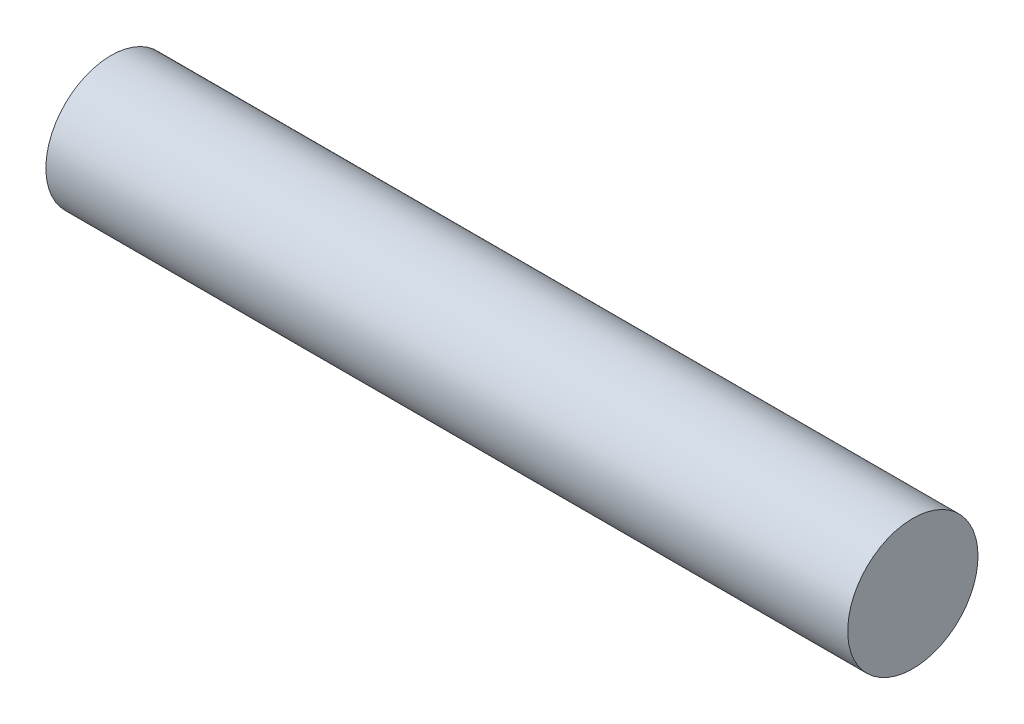
ISO-10303-21;
HEADER;
FILE_DESCRIPTION(('STEP AP214'),'2;1');
FILE_NAME('part.step','',(''),(''),'','','');
FILE_SCHEMA(('AUTOMOTIVE_DESIGN { 1 0 10303 214 1 1 1 1 }'));
ENDSEC;
DATA;
#1=APPLICATION_CONTEXT('core data for automotive mechanical design processes');
#2=APPLICATION_PROTOCOL_DEFINITION('international standard','automotive_design',2000,#1);
#3=PRODUCT_CONTEXT('',#1,'mechanical');
#4=PRODUCT('Part','Part','',(#3));
#5=PRODUCT_RELATED_PRODUCT_CATEGORY('part','',(#4));
#6=PRODUCT_DEFINITION_FORMATION('','',#4);
#7=PRODUCT_DEFINITION_CONTEXT('part definition',#1,'design');
#8=PRODUCT_DEFINITION('design','',#6,#7);
#9=PRODUCT_DEFINITION_SHAPE('','',#8);
#10=(LENGTH_UNIT() NAMED_UNIT(*) SI_UNIT(.MILLI.,.METRE.));
#11=(NAMED_UNIT(*) PLANE_ANGLE_UNIT() SI_UNIT($,.RADIAN.));
#12=(NAMED_UNIT(*) SI_UNIT($,.STERADIAN.) SOLID_ANGLE_UNIT());
#13=UNCERTAINTY_MEASURE_WITH_UNIT(LENGTH_MEASURE(1.E-05),#10,'distance_accuracy_value','');
#14=(GEOMETRIC_REPRESENTATION_CONTEXT(3) GLOBAL_UNCERTAINTY_ASSIGNED_CONTEXT((#13)) GLOBAL_UNIT_ASSIGNED_CONTEXT((#10,
#11,#12)) REPRESENTATION_CONTEXT('',''));
#15=CARTESIAN_POINT('',(0.,0.,0.));
#16=DIRECTION('',(0.,0.,1.));
#17=DIRECTION('',(1.,0.,0.));
#18=AXIS2_PLACEMENT_3D('',#15,#16,#17);
#19=CARTESIAN_POINT('',(8.,0.,0.));
#20=DIRECTION('',(-1.,0.,0.));
#21=DIRECTION('',(0.,0.,1.));
#22=AXIS2_PLACEMENT_3D('',#19,#20,#21);
#23=CYLINDRICAL_SURFACE('',#22,0.649999999999998);
#24=CARTESIAN_POINT('',(8.,0.,0.));
#25=DIRECTION('',(1.,0.,0.));
#26=DIRECTION('',(0.,0.,-1.));
#27=AXIS2_PLACEMENT_3D('',#24,#25,#26);
#28=CIRCLE('',#27,0.649999999999998);
#29=CARTESIAN_POINT('',(8.,0.,-0.649999999999998));
#30=VERTEX_POINT('',#29);
#31=EDGE_CURVE('E10',#30,#30,#28,.T.);
#32=ORIENTED_EDGE('',*,*,#31,.F.);
#33=EDGE_LOOP('',(#32));
#34=FACE_BOUND('',#33,.T.);
#35=CARTESIAN_POINT('',(0.,0.,0.));
#36=DIRECTION('',(1.,0.,0.));
#37=DIRECTION('',(0.,0.,-1.));
#38=AXIS2_PLACEMENT_3D('',#35,#36,#37);
#39=CIRCLE('',#38,0.649999999999998);
#40=CARTESIAN_POINT('',(0.,0.,-0.649999999999998));
#41=VERTEX_POINT('',#40);
#42=EDGE_CURVE('E32',#41,#41,#39,.T.);
#43=ORIENTED_EDGE('',*,*,#42,.T.);
#44=EDGE_LOOP('',(#43));
#45=FACE_BOUND('',#44,.T.);
#46=ADVANCED_FACE('F29',(#34,#45),#23,.T.);
#47=CARTESIAN_POINT('',(8.,0.,0.));
#48=DIRECTION('',(1.,0.,0.));
#49=DIRECTION('',(0.,0.,-1.));
#50=AXIS2_PLACEMENT_3D('',#47,#48,#49);
#51=PLANE('',#50);
#52=ORIENTED_EDGE('',*,*,#31,.T.);
#53=EDGE_LOOP('',(#52));
#54=FACE_BOUND('',#53,.T.);
#55=ADVANCED_FACE('F44',(#54),#51,.T.);
#56=CARTESIAN_POINT('',(0.,0.,0.));
#57=DIRECTION('',(1.,0.,0.));
#58=DIRECTION('',(0.,0.,-1.));
#59=AXIS2_PLACEMENT_3D('',#56,#57,#58);
#60=PLANE('',#59);
#61=ORIENTED_EDGE('',*,*,#42,.F.);
#62=EDGE_LOOP('',(#61));
#63=FACE_BOUND('',#62,.T.);
#64=ADVANCED_FACE('F42',(#63),#60,.F.);
#65=CLOSED_SHELL('',(#46,#55,#64));
#66=MANIFOLD_SOLID_BREP('B2',#65);
#67=ADVANCED_BREP_SHAPE_REPRESENTATION('',(#18,#66),#14);
#68=SHAPE_DEFINITION_REPRESENTATION(#9,#67);
ENDSEC;
END-ISO-10303-21;
